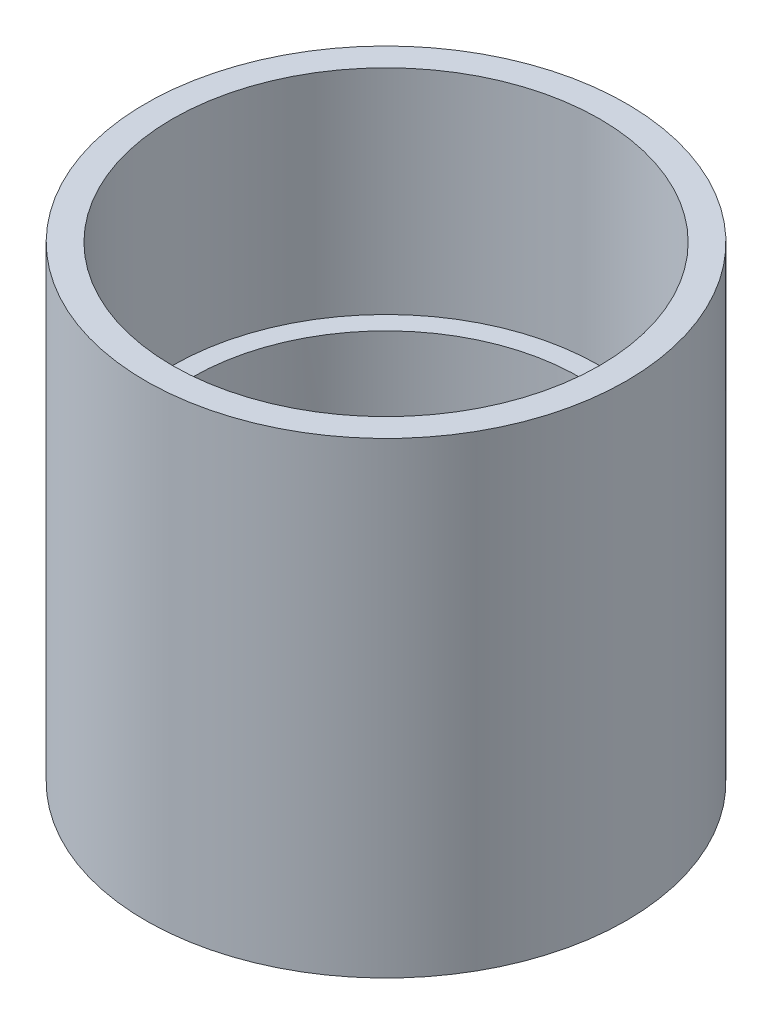
ISO-10303-21;
HEADER;
FILE_DESCRIPTION(('STEP AP214'),'2;1');
FILE_NAME('part.step','',(''),(''),'','','');
FILE_SCHEMA(('AUTOMOTIVE_DESIGN { 1 0 10303 214 1 1 1 1 }'));
ENDSEC;
DATA;
#1=APPLICATION_CONTEXT('core data for automotive mechanical design processes');
#2=APPLICATION_PROTOCOL_DEFINITION('international standard','automotive_design',2000,#1);
#3=PRODUCT_CONTEXT('',#1,'mechanical');
#4=PRODUCT('Part','Part','',(#3));
#5=PRODUCT_RELATED_PRODUCT_CATEGORY('part','',(#4));
#6=PRODUCT_DEFINITION_FORMATION('','',#4);
#7=PRODUCT_DEFINITION_CONTEXT('part definition',#1,'design');
#8=PRODUCT_DEFINITION('design','',#6,#7);
#9=PRODUCT_DEFINITION_SHAPE('','',#8);
#10=(LENGTH_UNIT() NAMED_UNIT(*) SI_UNIT(.MILLI.,.METRE.));
#11=(NAMED_UNIT(*) PLANE_ANGLE_UNIT() SI_UNIT($,.RADIAN.));
#12=(NAMED_UNIT(*) SI_UNIT($,.STERADIAN.) SOLID_ANGLE_UNIT());
#13=UNCERTAINTY_MEASURE_WITH_UNIT(LENGTH_MEASURE(1.E-05),#10,'distance_accuracy_value','');
#14=(GEOMETRIC_REPRESENTATION_CONTEXT(3) GLOBAL_UNCERTAINTY_ASSIGNED_CONTEXT((#13)) GLOBAL_UNIT_ASSIGNED_CONTEXT((#10,
#11,#12)) REPRESENTATION_CONTEXT('',''));
#15=CARTESIAN_POINT('',(0.,0.,0.));
#16=DIRECTION('',(0.,0.,1.));
#17=DIRECTION('',(1.,0.,0.));
#18=AXIS2_PLACEMENT_3D('',#15,#16,#17);
#19=CARTESIAN_POINT('',(5.00779517881601E-12,-1459.89261433869,0.));
#20=DIRECTION('',(0.,-1.,0.));
#21=DIRECTION('',(1.,0.,0.));
#22=AXIS2_PLACEMENT_3D('',#19,#20,#21);
#23=CYLINDRICAL_SURFACE('',#22,14.5);
#24=CARTESIAN_POINT('',(0.,-4.49999999999995,0.));
#25=DIRECTION('',(0.,-1.,0.));
#26=DIRECTION('',(1.,0.,0.));
#27=AXIS2_PLACEMENT_3D('',#24,#25,#26);
#28=CIRCLE('',#27,14.5);
#29=CARTESIAN_POINT('',(14.5,-4.4999999999999,0.));
#30=VERTEX_POINT('',#29);
#31=EDGE_CURVE('E57',#30,#30,#28,.T.);
#32=ORIENTED_EDGE('',*,*,#31,.T.);
#33=EDGE_LOOP('',(#32));
#34=FACE_BOUND('',#33,.T.);
#35=CARTESIAN_POINT('',(0.,1.50000000000006,0.));
#36=DIRECTION('',(0.,1.,0.));
#37=DIRECTION('',(-1.,0.,0.));
#38=AXIS2_PLACEMENT_3D('',#35,#36,#37);
#39=CIRCLE('',#38,14.5);
#40=CARTESIAN_POINT('',(-14.5,1.50000000000001,0.));
#41=VERTEX_POINT('',#40);
#42=EDGE_CURVE('E47',#41,#41,#39,.T.);
#43=ORIENTED_EDGE('',*,*,#42,.T.);
#44=EDGE_LOOP('',(#43));
#45=FACE_BOUND('',#44,.T.);
#46=ADVANCED_FACE('F43',(#34,#45),#23,.F.);
#47=CARTESIAN_POINT('',(18.,-17.5,0.));
#48=DIRECTION('',(0.,-1.,0.));
#49=DIRECTION('',(1.,0.,0.));
#50=AXIS2_PLACEMENT_3D('',#47,#48,#49);
#51=PLANE('',#50);
#52=CARTESIAN_POINT('',(0.,-17.5000000000001,0.));
#53=DIRECTION('',(0.,-1.,0.));
#54=DIRECTION('',(1.,0.,0.));
#55=AXIS2_PLACEMENT_3D('',#52,#53,#54);
#56=CIRCLE('',#55,17.9999999999999);
#57=CARTESIAN_POINT('',(18.,-17.5,0.));
#58=VERTEX_POINT('',#57);
#59=EDGE_CURVE('E67',#58,#58,#56,.T.);
#60=ORIENTED_EDGE('',*,*,#59,.T.);
#61=EDGE_LOOP('',(#60));
#62=FACE_BOUND('',#61,.T.);
#63=CARTESIAN_POINT('',(0.,-17.5000000000001,0.));
#64=DIRECTION('',(0.,-1.,0.));
#65=DIRECTION('',(1.,0.,0.));
#66=AXIS2_PLACEMENT_3D('',#63,#64,#65);
#67=CIRCLE('',#66,15.9999999999999);
#68=CARTESIAN_POINT('',(16.,-17.5,0.));
#69=VERTEX_POINT('',#68);
#70=EDGE_CURVE('E10',#69,#69,#67,.T.);
#71=ORIENTED_EDGE('',*,*,#70,.F.);
#72=EDGE_LOOP('',(#71));
#73=FACE_BOUND('',#72,.T.);
#74=ADVANCED_FACE('F45',(#62,#73),#51,.T.);
#75=CARTESIAN_POINT('',(5.00779517881601E-12,-1459.89261433869,0.));
#76=DIRECTION('',(0.,-1.,0.));
#77=DIRECTION('',(1.,0.,0.));
#78=AXIS2_PLACEMENT_3D('',#75,#76,#77);
#79=CYLINDRICAL_SURFACE('',#78,16.);
#80=ORIENTED_EDGE('',*,*,#70,.T.);
#81=EDGE_LOOP('',(#80));
#82=FACE_BOUND('',#81,.T.);
#83=CARTESIAN_POINT('',(0.,-4.49999999999995,0.));
#84=DIRECTION('',(0.,-1.,0.));
#85=DIRECTION('',(1.,0.,0.));
#86=AXIS2_PLACEMENT_3D('',#83,#84,#85);
#87=CIRCLE('',#86,16.);
#88=CARTESIAN_POINT('',(16.,-4.49999999999989,0.));
#89=VERTEX_POINT('',#88);
#90=EDGE_CURVE('E52',#89,#89,#87,.T.);
#91=ORIENTED_EDGE('',*,*,#90,.F.);
#92=EDGE_LOOP('',(#91));
#93=FACE_BOUND('',#92,.T.);
#94=ADVANCED_FACE('F103',(#82,#93),#79,.F.);
#95=CARTESIAN_POINT('',(16.,-4.49999999999999,0.));
#96=DIRECTION('',(0.,-1.,0.));
#97=DIRECTION('',(1.,0.,0.));
#98=AXIS2_PLACEMENT_3D('',#95,#96,#97);
#99=PLANE('',#98);
#100=ORIENTED_EDGE('',*,*,#90,.T.);
#101=EDGE_LOOP('',(#100));
#102=FACE_BOUND('',#101,.T.);
#103=ORIENTED_EDGE('',*,*,#31,.F.);
#104=EDGE_LOOP('',(#103));
#105=FACE_BOUND('',#104,.T.);
#106=ADVANCED_FACE('F109',(#102,#105),#99,.T.);
#107=CARTESIAN_POINT('',(14.5,17.5,0.));
#108=DIRECTION('',(0.,1.,0.));
#109=DIRECTION('',(-1.,0.,0.));
#110=AXIS2_PLACEMENT_3D('',#107,#108,#109);
#111=PLANE('',#110);
#112=CARTESIAN_POINT('',(0.,17.4999999999999,0.));
#113=DIRECTION('',(0.,1.,0.));
#114=DIRECTION('',(-1.,0.,0.));
#115=AXIS2_PLACEMENT_3D('',#112,#113,#114);
#116=CIRCLE('',#115,15.9999999999999);
#117=CARTESIAN_POINT('',(-16.,17.4999999999999,0.));
#118=VERTEX_POINT('',#117);
#119=EDGE_CURVE('E71',#118,#118,#116,.T.);
#120=ORIENTED_EDGE('',*,*,#119,.F.);
#121=EDGE_LOOP('',(#120));
#122=FACE_BOUND('',#121,.T.);
#123=CARTESIAN_POINT('',(0.,17.5000000000001,0.));
#124=DIRECTION('',(0.,-1.,0.));
#125=DIRECTION('',(1.,0.,0.));
#126=AXIS2_PLACEMENT_3D('',#123,#124,#125);
#127=CIRCLE('',#126,18.0000000000001);
#128=CARTESIAN_POINT('',(18.,17.5000000000001,0.));
#129=VERTEX_POINT('',#128);
#130=EDGE_CURVE('E63',#129,#129,#127,.T.);
#131=ORIENTED_EDGE('',*,*,#130,.F.);
#132=EDGE_LOOP('',(#131));
#133=FACE_BOUND('',#132,.T.);
#134=ADVANCED_FACE('F107',(#122,#133),#111,.T.);
#135=CARTESIAN_POINT('',(5.00779517881601E-12,-1459.89261433869,0.));
#136=DIRECTION('',(0.,-1.,0.));
#137=DIRECTION('',(1.,0.,0.));
#138=AXIS2_PLACEMENT_3D('',#135,#136,#137);
#139=CYLINDRICAL_SURFACE('',#138,18.);
#140=ORIENTED_EDGE('',*,*,#130,.T.);
#141=EDGE_LOOP('',(#140));
#142=FACE_BOUND('',#141,.T.);
#143=ORIENTED_EDGE('',*,*,#59,.F.);
#144=EDGE_LOOP('',(#143));
#145=FACE_BOUND('',#144,.T.);
#146=ADVANCED_FACE('F92',(#142,#145),#139,.T.);
#147=CARTESIAN_POINT('',(0.,1.49999999999995,0.));
#148=DIRECTION('',(0.,1.,0.));
#149=DIRECTION('',(-1.,0.,0.));
#150=AXIS2_PLACEMENT_3D('',#147,#148,#149);
#151=CYLINDRICAL_SURFACE('',#150,15.9999999999999);
#152=CARTESIAN_POINT('',(0.,1.49999999999995,0.));
#153=DIRECTION('',(0.,1.,0.));
#154=DIRECTION('',(-1.,0.,0.));
#155=AXIS2_PLACEMENT_3D('',#152,#153,#154);
#156=CIRCLE('',#155,15.9999999999999);
#157=CARTESIAN_POINT('',(-15.9999999999999,1.49999999999989,0.));
#158=VERTEX_POINT('',#157);
#159=EDGE_CURVE('E75',#158,#158,#156,.T.);
#160=ORIENTED_EDGE('',*,*,#159,.F.);
#161=EDGE_LOOP('',(#160));
#162=FACE_BOUND('',#161,.T.);
#163=ORIENTED_EDGE('',*,*,#119,.T.);
#164=EDGE_LOOP('',(#163));
#165=FACE_BOUND('',#164,.T.);
#166=ADVANCED_FACE('F87',(#162,#165),#151,.F.);
#167=CARTESIAN_POINT('',(0.,1.49999999999995,0.));
#168=DIRECTION('',(0.,1.,0.));
#169=DIRECTION('',(-1.,0.,0.));
#170=AXIS2_PLACEMENT_3D('',#167,#168,#169);
#171=PLANE('',#170);
#172=ORIENTED_EDGE('',*,*,#42,.F.);
#173=EDGE_LOOP('',(#172));
#174=FACE_BOUND('',#173,.T.);
#175=ORIENTED_EDGE('',*,*,#159,.T.);
#176=EDGE_LOOP('',(#175));
#177=FACE_BOUND('',#176,.T.);
#178=ADVANCED_FACE('F85',(#174,#177),#171,.T.);
#179=CLOSED_SHELL('',(#46,#74,#94,#106,#134,#146,#166,#178));
#180=MANIFOLD_SOLID_BREP('B2',#179);
#181=ADVANCED_BREP_SHAPE_REPRESENTATION('',(#18,#180),#14);
#182=SHAPE_DEFINITION_REPRESENTATION(#9,#181);
ENDSEC;
END-ISO-10303-21;
